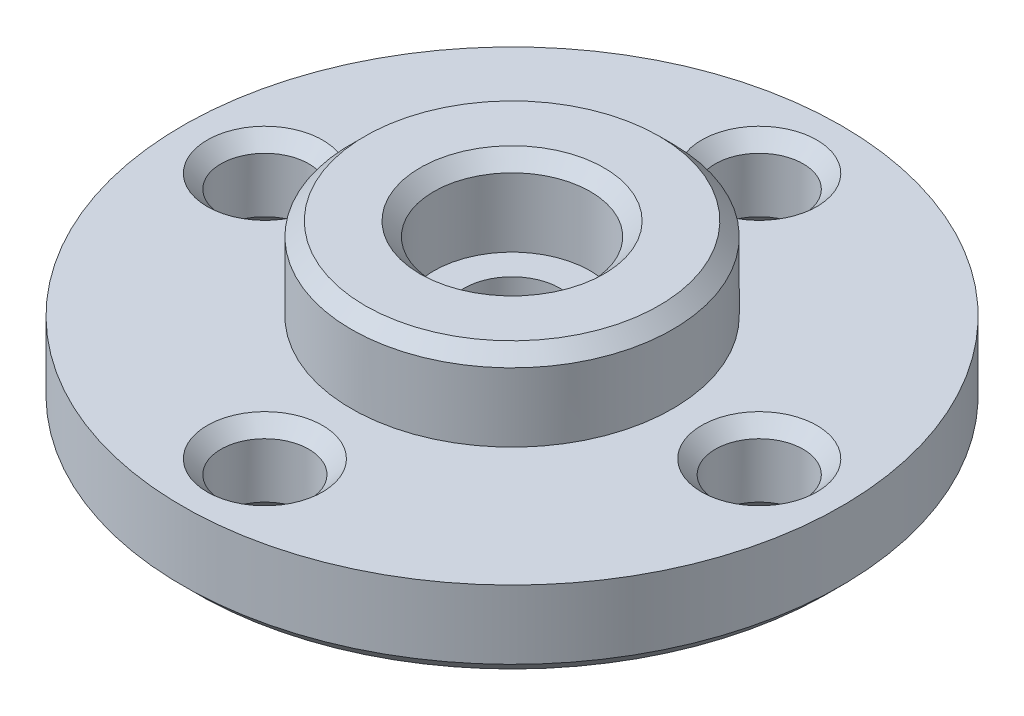
ISO-10303-21;
HEADER;
FILE_DESCRIPTION(('STEP AP214'),'2;1');
FILE_NAME('part.step','',(''),(''),'','','');
FILE_SCHEMA(('AUTOMOTIVE_DESIGN { 1 0 10303 214 1 1 1 1 }'));
ENDSEC;
DATA;
#1=APPLICATION_CONTEXT('core data for automotive mechanical design processes');
#2=APPLICATION_PROTOCOL_DEFINITION('international standard','automotive_design',2000,#1);
#3=PRODUCT_CONTEXT('',#1,'mechanical');
#4=PRODUCT('Part','Part','',(#3));
#5=PRODUCT_RELATED_PRODUCT_CATEGORY('part','',(#4));
#6=PRODUCT_DEFINITION_FORMATION('','',#4);
#7=PRODUCT_DEFINITION_CONTEXT('part definition',#1,'design');
#8=PRODUCT_DEFINITION('design','',#6,#7);
#9=PRODUCT_DEFINITION_SHAPE('','',#8);
#10=(LENGTH_UNIT() NAMED_UNIT(*) SI_UNIT(.MILLI.,.METRE.));
#11=(NAMED_UNIT(*) PLANE_ANGLE_UNIT() SI_UNIT($,.RADIAN.));
#12=(NAMED_UNIT(*) SI_UNIT($,.STERADIAN.) SOLID_ANGLE_UNIT());
#13=UNCERTAINTY_MEASURE_WITH_UNIT(LENGTH_MEASURE(1.E-05),#10,'distance_accuracy_value','');
#14=(GEOMETRIC_REPRESENTATION_CONTEXT(3) GLOBAL_UNCERTAINTY_ASSIGNED_CONTEXT((#13)) GLOBAL_UNIT_ASSIGNED_CONTEXT((#10,
#11,#12)) REPRESENTATION_CONTEXT('',''));
#15=CARTESIAN_POINT('',(0.,0.,0.));
#16=DIRECTION('',(0.,0.,1.));
#17=DIRECTION('',(1.,0.,0.));
#18=AXIS2_PLACEMENT_3D('',#15,#16,#17);
#19=CARTESIAN_POINT('',(12.,0.,0.));
#20=DIRECTION('',(0.,-1.,0.));
#21=DIRECTION('',(0.,0.,-1.));
#22=AXIS2_PLACEMENT_3D('',#19,#20,#21);
#23=PLANE('',#22);
#24=CARTESIAN_POINT('',(0.,0.,0.));
#25=DIRECTION('',(0.,-1.,0.));
#26=DIRECTION('',(0.,0.,-1.));
#27=AXIS2_PLACEMENT_3D('',#24,#25,#26);
#28=CIRCLE('',#27,2.25);
#29=CARTESIAN_POINT('',(0.,0.,-2.25));
#30=VERTEX_POINT('',#29);
#31=EDGE_CURVE('E90',#30,#30,#28,.F.);
#32=ORIENTED_EDGE('',*,*,#31,.T.);
#33=EDGE_LOOP('',(#32));
#34=FACE_BOUND('',#33,.T.);
#35=CARTESIAN_POINT('',(0.,0.,0.));
#36=DIRECTION('',(0.,-1.,0.));
#37=DIRECTION('',(0.,0.,-1.));
#38=AXIS2_PLACEMENT_3D('',#35,#36,#37);
#39=CIRCLE('',#38,11.5);
#40=CARTESIAN_POINT('',(0.,0.,-11.5));
#41=VERTEX_POINT('',#40);
#42=EDGE_CURVE('E93',#41,#41,#39,.T.);
#43=ORIENTED_EDGE('',*,*,#42,.T.);
#44=EDGE_LOOP('',(#43));
#45=FACE_BOUND('',#44,.T.);
#46=CARTESIAN_POINT('',(9.,0.,0.));
#47=DIRECTION('',(0.,-1.,0.));
#48=DIRECTION('',(0.,0.,-1.));
#49=AXIS2_PLACEMENT_3D('',#46,#47,#48);
#50=CIRCLE('',#49,2.10000000000001);
#51=CARTESIAN_POINT('',(9.,0.,-2.10000000000001));
#52=VERTEX_POINT('',#51);
#53=EDGE_CURVE('E96',#52,#52,#50,.F.);
#54=ORIENTED_EDGE('',*,*,#53,.T.);
#55=EDGE_LOOP('',(#54));
#56=FACE_BOUND('',#55,.T.);
#57=CARTESIAN_POINT('',(0.,0.,9.));
#58=DIRECTION('',(0.,-1.,0.));
#59=DIRECTION('',(0.,0.,-1.));
#60=AXIS2_PLACEMENT_3D('',#57,#58,#59);
#61=CIRCLE('',#60,2.10000000000001);
#62=CARTESIAN_POINT('',(0.,0.,6.89999999999999));
#63=VERTEX_POINT('',#62);
#64=EDGE_CURVE('E99',#63,#63,#61,.F.);
#65=ORIENTED_EDGE('',*,*,#64,.T.);
#66=EDGE_LOOP('',(#65));
#67=FACE_BOUND('',#66,.T.);
#68=CARTESIAN_POINT('',(-9.,0.,0.));
#69=DIRECTION('',(0.,-1.,0.));
#70=DIRECTION('',(0.,0.,-1.));
#71=AXIS2_PLACEMENT_3D('',#68,#69,#70);
#72=CIRCLE('',#71,2.10000000000001);
#73=CARTESIAN_POINT('',(-9.,0.,-2.10000000000001));
#74=VERTEX_POINT('',#73);
#75=EDGE_CURVE('E102',#74,#74,#72,.F.);
#76=ORIENTED_EDGE('',*,*,#75,.T.);
#77=EDGE_LOOP('',(#76));
#78=FACE_BOUND('',#77,.T.);
#79=CARTESIAN_POINT('',(0.,0.,-9.));
#80=DIRECTION('',(0.,-1.,0.));
#81=DIRECTION('',(0.,0.,-1.));
#82=AXIS2_PLACEMENT_3D('',#79,#80,#81);
#83=CIRCLE('',#82,2.10000000000001);
#84=CARTESIAN_POINT('',(0.,0.,-11.1));
#85=VERTEX_POINT('',#84);
#86=EDGE_CURVE('E105',#85,#85,#83,.F.);
#87=ORIENTED_EDGE('',*,*,#86,.T.);
#88=EDGE_LOOP('',(#87));
#89=FACE_BOUND('',#88,.T.);
#90=ADVANCED_FACE('F31',(#34,#45,#56,#67,#78,#89),#23,.T.);
#91=CARTESIAN_POINT('',(0.,-26.6259795405371,0.));
#92=DIRECTION('',(0.,-1.,0.));
#93=DIRECTION('',(0.,0.,-1.));
#94=AXIS2_PLACEMENT_3D('',#91,#92,#93);
#95=CYLINDRICAL_SURFACE('',#94,1.75);
#96=CARTESIAN_POINT('',(0.,0.499999999999997,0.));
#97=DIRECTION('',(0.,-1.,0.));
#98=DIRECTION('',(0.,0.,-1.));
#99=AXIS2_PLACEMENT_3D('',#96,#97,#98);
#100=CIRCLE('',#99,1.75);
#101=CARTESIAN_POINT('',(0.,0.499999999999997,-1.75));
#102=VERTEX_POINT('',#101);
#103=EDGE_CURVE('E108',#102,#102,#100,.T.);
#104=ORIENTED_EDGE('',*,*,#103,.T.);
#105=EDGE_LOOP('',(#104));
#106=FACE_BOUND('',#105,.T.);
#107=CARTESIAN_POINT('',(0.,3.,0.));
#108=DIRECTION('',(0.,-1.,0.));
#109=DIRECTION('',(0.,0.,-1.));
#110=AXIS2_PLACEMENT_3D('',#107,#108,#109);
#111=CIRCLE('',#110,1.75);
#112=CARTESIAN_POINT('',(0.,3.,-1.75));
#113=VERTEX_POINT('',#112);
#114=EDGE_CURVE('E111',#113,#113,#111,.T.);
#115=ORIENTED_EDGE('',*,*,#114,.F.);
#116=EDGE_LOOP('',(#115));
#117=FACE_BOUND('',#116,.T.);
#118=ADVANCED_FACE('F142',(#106,#117),#95,.F.);
#119=CARTESIAN_POINT('',(1.75,3.,0.));
#120=DIRECTION('',(0.,1.,0.));
#121=DIRECTION('',(0.,0.,1.));
#122=AXIS2_PLACEMENT_3D('',#119,#120,#121);
#123=PLANE('',#122);
#124=ORIENTED_EDGE('',*,*,#114,.T.);
#125=EDGE_LOOP('',(#124));
#126=FACE_BOUND('',#125,.T.);
#127=CARTESIAN_POINT('',(0.,3.,0.));
#128=DIRECTION('',(0.,-1.,0.));
#129=DIRECTION('',(0.,0.,-1.));
#130=AXIS2_PLACEMENT_3D('',#127,#128,#129);
#131=CIRCLE('',#130,2.85);
#132=CARTESIAN_POINT('',(0.,3.,-2.85));
#133=VERTEX_POINT('',#132);
#134=EDGE_CURVE('E114',#133,#133,#131,.T.);
#135=ORIENTED_EDGE('',*,*,#134,.F.);
#136=EDGE_LOOP('',(#135));
#137=FACE_BOUND('',#136,.T.);
#138=ADVANCED_FACE('F148',(#126,#137),#123,.T.);
#139=CARTESIAN_POINT('',(0.,-26.6259795405371,0.));
#140=DIRECTION('',(0.,-1.,0.));
#141=DIRECTION('',(0.,0.,-1.));
#142=AXIS2_PLACEMENT_3D('',#139,#140,#141);
#143=CYLINDRICAL_SURFACE('',#142,2.85);
#144=CARTESIAN_POINT('',(0.,5.49999999999999,0.));
#145=DIRECTION('',(0.,1.,0.));
#146=DIRECTION('',(0.,0.,1.));
#147=AXIS2_PLACEMENT_3D('',#144,#145,#146);
#148=CIRCLE('',#147,2.85);
#149=CARTESIAN_POINT('',(0.,5.49999999999999,2.85));
#150=VERTEX_POINT('',#149);
#151=EDGE_CURVE('E38',#150,#150,#148,.T.);
#152=ORIENTED_EDGE('',*,*,#151,.T.);
#153=EDGE_LOOP('',(#152));
#154=FACE_BOUND('',#153,.T.);
#155=ORIENTED_EDGE('',*,*,#134,.T.);
#156=EDGE_LOOP('',(#155));
#157=FACE_BOUND('',#156,.T.);
#158=ADVANCED_FACE('F206',(#154,#157),#143,.F.);
#159=CARTESIAN_POINT('',(2.85,6.,0.));
#160=DIRECTION('',(0.,1.,0.));
#161=DIRECTION('',(0.,0.,1.));
#162=AXIS2_PLACEMENT_3D('',#159,#160,#161);
#163=PLANE('',#162);
#164=CARTESIAN_POINT('',(0.,6.,0.));
#165=DIRECTION('',(0.,1.,0.));
#166=DIRECTION('',(0.,0.,1.));
#167=AXIS2_PLACEMENT_3D('',#164,#165,#166);
#168=CIRCLE('',#167,3.35000000000001);
#169=CARTESIAN_POINT('',(0.,6.,3.35000000000001));
#170=VERTEX_POINT('',#169);
#171=EDGE_CURVE('E42',#170,#170,#168,.F.);
#172=ORIENTED_EDGE('',*,*,#171,.T.);
#173=EDGE_LOOP('',(#172));
#174=FACE_BOUND('',#173,.T.);
#175=CARTESIAN_POINT('',(0.,6.,0.));
#176=DIRECTION('',(0.,1.,0.));
#177=DIRECTION('',(0.,0.,1.));
#178=AXIS2_PLACEMENT_3D('',#175,#176,#177);
#179=CIRCLE('',#178,5.34999999999999);
#180=CARTESIAN_POINT('',(0.,6.,5.34999999999999));
#181=VERTEX_POINT('',#180);
#182=EDGE_CURVE('E46',#181,#181,#179,.T.);
#183=ORIENTED_EDGE('',*,*,#182,.T.);
#184=EDGE_LOOP('',(#183));
#185=FACE_BOUND('',#184,.T.);
#186=ADVANCED_FACE('F138',(#174,#185),#163,.T.);
#187=CARTESIAN_POINT('',(0.,-26.6259795405371,0.));
#188=DIRECTION('',(0.,-1.,0.));
#189=DIRECTION('',(0.,0.,-1.));
#190=AXIS2_PLACEMENT_3D('',#187,#188,#189);
#191=CYLINDRICAL_SURFACE('',#190,5.85);
#192=CARTESIAN_POINT('',(0.,5.5,0.));
#193=DIRECTION('',(0.,1.,0.));
#194=DIRECTION('',(0.,0.,1.));
#195=AXIS2_PLACEMENT_3D('',#192,#193,#194);
#196=CIRCLE('',#195,5.85);
#197=CARTESIAN_POINT('',(0.,5.5,5.85));
#198=VERTEX_POINT('',#197);
#199=EDGE_CURVE('E10',#198,#198,#196,.F.);
#200=ORIENTED_EDGE('',*,*,#199,.T.);
#201=EDGE_LOOP('',(#200));
#202=FACE_BOUND('',#201,.T.);
#203=CARTESIAN_POINT('',(0.,3.,0.));
#204=DIRECTION('',(0.,-1.,0.));
#205=DIRECTION('',(0.,0.,-1.));
#206=AXIS2_PLACEMENT_3D('',#203,#204,#205);
#207=CIRCLE('',#206,5.85);
#208=CARTESIAN_POINT('',(0.,3.,-5.85));
#209=VERTEX_POINT('',#208);
#210=EDGE_CURVE('E117',#209,#209,#207,.T.);
#211=ORIENTED_EDGE('',*,*,#210,.F.);
#212=EDGE_LOOP('',(#211));
#213=FACE_BOUND('',#212,.T.);
#214=ADVANCED_FACE('F128',(#202,#213),#191,.T.);
#215=CARTESIAN_POINT('',(5.85,3.,0.));
#216=DIRECTION('',(0.,1.,0.));
#217=DIRECTION('',(0.,0.,1.));
#218=AXIS2_PLACEMENT_3D('',#215,#216,#217);
#219=PLANE('',#218);
#220=CARTESIAN_POINT('',(0.,3.,9.));
#221=DIRECTION('',(0.,1.,0.));
#222=DIRECTION('',(0.,0.,1.));
#223=AXIS2_PLACEMENT_3D('',#220,#221,#222);
#224=CIRCLE('',#223,2.1);
#225=CARTESIAN_POINT('',(0.,3.,11.1));
#226=VERTEX_POINT('',#225);
#227=EDGE_CURVE('E51',#226,#226,#224,.F.);
#228=ORIENTED_EDGE('',*,*,#227,.T.);
#229=EDGE_LOOP('',(#228));
#230=FACE_BOUND('',#229,.T.);
#231=CARTESIAN_POINT('',(-9.,3.,0.));
#232=DIRECTION('',(0.,1.,0.));
#233=DIRECTION('',(0.,0.,1.));
#234=AXIS2_PLACEMENT_3D('',#231,#232,#233);
#235=CIRCLE('',#234,2.1);
#236=CARTESIAN_POINT('',(-9.,3.,2.1));
#237=VERTEX_POINT('',#236);
#238=EDGE_CURVE('E54',#237,#237,#235,.F.);
#239=ORIENTED_EDGE('',*,*,#238,.T.);
#240=EDGE_LOOP('',(#239));
#241=FACE_BOUND('',#240,.T.);
#242=CARTESIAN_POINT('',(0.,3.,-9.));
#243=DIRECTION('',(0.,1.,0.));
#244=DIRECTION('',(0.,0.,1.));
#245=AXIS2_PLACEMENT_3D('',#242,#243,#244);
#246=CIRCLE('',#245,2.1);
#247=CARTESIAN_POINT('',(0.,3.,-6.9));
#248=VERTEX_POINT('',#247);
#249=EDGE_CURVE('E57',#248,#248,#246,.F.);
#250=ORIENTED_EDGE('',*,*,#249,.T.);
#251=EDGE_LOOP('',(#250));
#252=FACE_BOUND('',#251,.T.);
#253=CARTESIAN_POINT('',(9.,3.,0.));
#254=DIRECTION('',(0.,1.,0.));
#255=DIRECTION('',(0.,0.,1.));
#256=AXIS2_PLACEMENT_3D('',#253,#254,#255);
#257=CIRCLE('',#256,2.1);
#258=CARTESIAN_POINT('',(9.,3.,2.1));
#259=VERTEX_POINT('',#258);
#260=EDGE_CURVE('E60',#259,#259,#257,.F.);
#261=ORIENTED_EDGE('',*,*,#260,.T.);
#262=EDGE_LOOP('',(#261));
#263=FACE_BOUND('',#262,.T.);
#264=ORIENTED_EDGE('',*,*,#210,.T.);
#265=EDGE_LOOP('',(#264));
#266=FACE_BOUND('',#265,.T.);
#267=CARTESIAN_POINT('',(0.,3.,0.));
#268=DIRECTION('',(0.,-1.,0.));
#269=DIRECTION('',(0.,0.,-1.));
#270=AXIS2_PLACEMENT_3D('',#267,#268,#269);
#271=CIRCLE('',#270,12.);
#272=CARTESIAN_POINT('',(0.,3.,-12.));
#273=VERTEX_POINT('',#272);
#274=EDGE_CURVE('E120',#273,#273,#271,.T.);
#275=ORIENTED_EDGE('',*,*,#274,.F.);
#276=EDGE_LOOP('',(#275));
#277=FACE_BOUND('',#276,.T.);
#278=ADVANCED_FACE('F126',(#230,#241,#252,#263,#266,#277),#219,.T.);
#279=CARTESIAN_POINT('',(0.,-26.6259795405371,0.));
#280=DIRECTION('',(0.,-1.,0.));
#281=DIRECTION('',(0.,0.,-1.));
#282=AXIS2_PLACEMENT_3D('',#279,#280,#281);
#283=CYLINDRICAL_SURFACE('',#282,12.);
#284=CARTESIAN_POINT('',(0.,0.499999999999997,0.));
#285=DIRECTION('',(0.,-1.,0.));
#286=DIRECTION('',(0.,0.,-1.));
#287=AXIS2_PLACEMENT_3D('',#284,#285,#286);
#288=CIRCLE('',#287,12.);
#289=CARTESIAN_POINT('',(0.,0.499999999999997,-12.));
#290=VERTEX_POINT('',#289);
#291=EDGE_CURVE('E87',#290,#290,#288,.F.);
#292=ORIENTED_EDGE('',*,*,#291,.T.);
#293=EDGE_LOOP('',(#292));
#294=FACE_BOUND('',#293,.T.);
#295=ORIENTED_EDGE('',*,*,#274,.T.);
#296=EDGE_LOOP('',(#295));
#297=FACE_BOUND('',#296,.T.);
#298=ADVANCED_FACE('F124',(#294,#297),#283,.T.);
#299=CARTESIAN_POINT('',(9.,0.,0.));
#300=DIRECTION('',(0.,1.,0.));
#301=DIRECTION('',(0.,0.,1.));
#302=AXIS2_PLACEMENT_3D('',#299,#300,#301);
#303=CYLINDRICAL_SURFACE('',#302,1.6);
#304=CARTESIAN_POINT('',(9.,0.500000000000007,0.));
#305=DIRECTION('',(0.,-1.,0.));
#306=DIRECTION('',(0.,0.,-1.));
#307=AXIS2_PLACEMENT_3D('',#304,#305,#306);
#308=CIRCLE('',#307,1.6);
#309=CARTESIAN_POINT('',(9.,0.500000000000007,-1.6));
#310=VERTEX_POINT('',#309);
#311=EDGE_CURVE('E81',#310,#310,#308,.T.);
#312=ORIENTED_EDGE('',*,*,#311,.T.);
#313=EDGE_LOOP('',(#312));
#314=FACE_BOUND('',#313,.T.);
#315=CARTESIAN_POINT('',(9.,2.5,0.));
#316=DIRECTION('',(0.,1.,0.));
#317=DIRECTION('',(0.,0.,1.));
#318=AXIS2_PLACEMENT_3D('',#315,#316,#317);
#319=CIRCLE('',#318,1.6);
#320=CARTESIAN_POINT('',(9.,2.5,1.6));
#321=VERTEX_POINT('',#320);
#322=EDGE_CURVE('E84',#321,#321,#319,.T.);
#323=ORIENTED_EDGE('',*,*,#322,.T.);
#324=EDGE_LOOP('',(#323));
#325=FACE_BOUND('',#324,.T.);
#326=ADVANCED_FACE('F135',(#314,#325),#303,.F.);
#327=CARTESIAN_POINT('',(0.,0.,9.));
#328=DIRECTION('',(0.,1.,0.));
#329=DIRECTION('',(0.,0.,1.));
#330=AXIS2_PLACEMENT_3D('',#327,#328,#329);
#331=CYLINDRICAL_SURFACE('',#330,1.6);
#332=CARTESIAN_POINT('',(0.,0.500000000000007,9.));
#333=DIRECTION('',(0.,-1.,0.));
#334=DIRECTION('',(0.,0.,-1.));
#335=AXIS2_PLACEMENT_3D('',#332,#333,#334);
#336=CIRCLE('',#335,1.6);
#337=CARTESIAN_POINT('',(0.,0.500000000000007,7.4));
#338=VERTEX_POINT('',#337);
#339=EDGE_CURVE('E75',#338,#338,#336,.T.);
#340=ORIENTED_EDGE('',*,*,#339,.T.);
#341=EDGE_LOOP('',(#340));
#342=FACE_BOUND('',#341,.T.);
#343=CARTESIAN_POINT('',(0.,2.5,9.));
#344=DIRECTION('',(0.,1.,0.));
#345=DIRECTION('',(0.,0.,1.));
#346=AXIS2_PLACEMENT_3D('',#343,#344,#345);
#347=CIRCLE('',#346,1.6);
#348=CARTESIAN_POINT('',(0.,2.5,10.6));
#349=VERTEX_POINT('',#348);
#350=EDGE_CURVE('E78',#349,#349,#347,.T.);
#351=ORIENTED_EDGE('',*,*,#350,.T.);
#352=EDGE_LOOP('',(#351));
#353=FACE_BOUND('',#352,.T.);
#354=ADVANCED_FACE('F260',(#342,#353),#331,.F.);
#355=CARTESIAN_POINT('',(-9.,0.,0.));
#356=DIRECTION('',(0.,1.,0.));
#357=DIRECTION('',(0.,0.,1.));
#358=AXIS2_PLACEMENT_3D('',#355,#356,#357);
#359=CYLINDRICAL_SURFACE('',#358,1.6);
#360=CARTESIAN_POINT('',(-9.,0.500000000000007,0.));
#361=DIRECTION('',(0.,-1.,0.));
#362=DIRECTION('',(0.,0.,-1.));
#363=AXIS2_PLACEMENT_3D('',#360,#361,#362);
#364=CIRCLE('',#363,1.6);
#365=CARTESIAN_POINT('',(-9.,0.500000000000007,-1.6));
#366=VERTEX_POINT('',#365);
#367=EDGE_CURVE('E69',#366,#366,#364,.T.);
#368=ORIENTED_EDGE('',*,*,#367,.T.);
#369=EDGE_LOOP('',(#368));
#370=FACE_BOUND('',#369,.T.);
#371=CARTESIAN_POINT('',(-9.,2.5,0.));
#372=DIRECTION('',(0.,1.,0.));
#373=DIRECTION('',(0.,0.,1.));
#374=AXIS2_PLACEMENT_3D('',#371,#372,#373);
#375=CIRCLE('',#374,1.6);
#376=CARTESIAN_POINT('',(-9.,2.5,1.6));
#377=VERTEX_POINT('',#376);
#378=EDGE_CURVE('E72',#377,#377,#375,.T.);
#379=ORIENTED_EDGE('',*,*,#378,.T.);
#380=EDGE_LOOP('',(#379));
#381=FACE_BOUND('',#380,.T.);
#382=ADVANCED_FACE('F270',(#370,#381),#359,.F.);
#383=CARTESIAN_POINT('',(0.,0.,-9.));
#384=DIRECTION('',(0.,1.,0.));
#385=DIRECTION('',(0.,0.,1.));
#386=AXIS2_PLACEMENT_3D('',#383,#384,#385);
#387=CYLINDRICAL_SURFACE('',#386,1.6);
#388=CARTESIAN_POINT('',(0.,0.500000000000007,-9.));
#389=DIRECTION('',(0.,-1.,0.));
#390=DIRECTION('',(0.,0.,-1.));
#391=AXIS2_PLACEMENT_3D('',#388,#389,#390);
#392=CIRCLE('',#391,1.6);
#393=CARTESIAN_POINT('',(0.,0.500000000000007,-10.6));
#394=VERTEX_POINT('',#393);
#395=EDGE_CURVE('E63',#394,#394,#392,.T.);
#396=ORIENTED_EDGE('',*,*,#395,.T.);
#397=EDGE_LOOP('',(#396));
#398=FACE_BOUND('',#397,.T.);
#399=CARTESIAN_POINT('',(0.,2.5,-9.));
#400=DIRECTION('',(0.,1.,0.));
#401=DIRECTION('',(0.,0.,1.));
#402=AXIS2_PLACEMENT_3D('',#399,#400,#401);
#403=CIRCLE('',#402,1.6);
#404=CARTESIAN_POINT('',(0.,2.5,-7.4));
#405=VERTEX_POINT('',#404);
#406=EDGE_CURVE('E66',#405,#405,#403,.T.);
#407=ORIENTED_EDGE('',*,*,#406,.T.);
#408=EDGE_LOOP('',(#407));
#409=FACE_BOUND('',#408,.T.);
#410=ADVANCED_FACE('F158',(#398,#409),#387,.F.);
#411=CARTESIAN_POINT('',(0.,0.499999999999997,0.));
#412=DIRECTION('',(0.,-1.,0.));
#413=DIRECTION('',(0.,0.,-1.));
#414=AXIS2_PLACEMENT_3D('',#411,#412,#413);
#415=CONICAL_SURFACE('',#414,1.75,0.785398163397453);
#416=ORIENTED_EDGE('',*,*,#31,.F.);
#417=EDGE_LOOP('',(#416));
#418=FACE_BOUND('',#417,.T.);
#419=ORIENTED_EDGE('',*,*,#103,.F.);
#420=EDGE_LOOP('',(#419));
#421=FACE_BOUND('',#420,.T.);
#422=ADVANCED_FACE('F154',(#418,#421),#415,.F.);
#423=CARTESIAN_POINT('',(0.,0.,0.));
#424=DIRECTION('',(0.,1.,0.));
#425=DIRECTION('',(0.,0.,1.));
#426=AXIS2_PLACEMENT_3D('',#423,#424,#425);
#427=CONICAL_SURFACE('',#426,11.5,0.785398163397447);
#428=ORIENTED_EDGE('',*,*,#291,.F.);
#429=EDGE_LOOP('',(#428));
#430=FACE_BOUND('',#429,.T.);
#431=ORIENTED_EDGE('',*,*,#42,.F.);
#432=EDGE_LOOP('',(#431));
#433=FACE_BOUND('',#432,.T.);
#434=ADVANCED_FACE('F157',(#430,#433),#427,.T.);
#435=CARTESIAN_POINT('',(9.,0.,0.));
#436=DIRECTION('',(0.,-1.,0.));
#437=DIRECTION('',(0.,0.,-1.));
#438=AXIS2_PLACEMENT_3D('',#435,#436,#437);
#439=CONICAL_SURFACE('',#438,2.10000000000001,0.785398163397447);
#440=ORIENTED_EDGE('',*,*,#311,.F.);
#441=EDGE_LOOP('',(#440));
#442=FACE_BOUND('',#441,.T.);
#443=ORIENTED_EDGE('',*,*,#53,.F.);
#444=EDGE_LOOP('',(#443));
#445=FACE_BOUND('',#444,.T.);
#446=ADVANCED_FACE('F162',(#442,#445),#439,.F.);
#447=CARTESIAN_POINT('',(0.,0.,9.));
#448=DIRECTION('',(0.,-1.,0.));
#449=DIRECTION('',(0.,0.,-1.));
#450=AXIS2_PLACEMENT_3D('',#447,#448,#449);
#451=CONICAL_SURFACE('',#450,2.10000000000001,0.785398163397447);
#452=ORIENTED_EDGE('',*,*,#339,.F.);
#453=EDGE_LOOP('',(#452));
#454=FACE_BOUND('',#453,.T.);
#455=ORIENTED_EDGE('',*,*,#64,.F.);
#456=EDGE_LOOP('',(#455));
#457=FACE_BOUND('',#456,.T.);
#458=ADVANCED_FACE('F166',(#454,#457),#451,.F.);
#459=CARTESIAN_POINT('',(-9.,0.,0.));
#460=DIRECTION('',(0.,-1.,0.));
#461=DIRECTION('',(0.,0.,-1.));
#462=AXIS2_PLACEMENT_3D('',#459,#460,#461);
#463=CONICAL_SURFACE('',#462,2.10000000000001,0.785398163397447);
#464=ORIENTED_EDGE('',*,*,#367,.F.);
#465=EDGE_LOOP('',(#464));
#466=FACE_BOUND('',#465,.T.);
#467=ORIENTED_EDGE('',*,*,#75,.F.);
#468=EDGE_LOOP('',(#467));
#469=FACE_BOUND('',#468,.T.);
#470=ADVANCED_FACE('F170',(#466,#469),#463,.F.);
#471=CARTESIAN_POINT('',(0.,0.,-9.));
#472=DIRECTION('',(0.,-1.,0.));
#473=DIRECTION('',(0.,0.,-1.));
#474=AXIS2_PLACEMENT_3D('',#471,#472,#473);
#475=CONICAL_SURFACE('',#474,2.10000000000001,0.785398163397447);
#476=ORIENTED_EDGE('',*,*,#395,.F.);
#477=EDGE_LOOP('',(#476));
#478=FACE_BOUND('',#477,.T.);
#479=ORIENTED_EDGE('',*,*,#86,.F.);
#480=EDGE_LOOP('',(#479));
#481=FACE_BOUND('',#480,.T.);
#482=ADVANCED_FACE('F174',(#478,#481),#475,.F.);
#483=CARTESIAN_POINT('',(0.,2.5,9.));
#484=DIRECTION('',(0.,1.,0.));
#485=DIRECTION('',(0.,0.,1.));
#486=AXIS2_PLACEMENT_3D('',#483,#484,#485);
#487=CONICAL_SURFACE('',#486,1.6,0.78539816339745);
#488=ORIENTED_EDGE('',*,*,#227,.F.);
#489=EDGE_LOOP('',(#488));
#490=FACE_BOUND('',#489,.T.);
#491=ORIENTED_EDGE('',*,*,#350,.F.);
#492=EDGE_LOOP('',(#491));
#493=FACE_BOUND('',#492,.T.);
#494=ADVANCED_FACE('F178',(#490,#493),#487,.F.);
#495=CARTESIAN_POINT('',(-9.,2.5,0.));
#496=DIRECTION('',(0.,1.,0.));
#497=DIRECTION('',(0.,0.,1.));
#498=AXIS2_PLACEMENT_3D('',#495,#496,#497);
#499=CONICAL_SURFACE('',#498,1.6,0.78539816339745);
#500=ORIENTED_EDGE('',*,*,#238,.F.);
#501=EDGE_LOOP('',(#500));
#502=FACE_BOUND('',#501,.T.);
#503=ORIENTED_EDGE('',*,*,#378,.F.);
#504=EDGE_LOOP('',(#503));
#505=FACE_BOUND('',#504,.T.);
#506=ADVANCED_FACE('F182',(#502,#505),#499,.F.);
#507=CARTESIAN_POINT('',(0.,2.5,-9.));
#508=DIRECTION('',(0.,1.,0.));
#509=DIRECTION('',(0.,0.,1.));
#510=AXIS2_PLACEMENT_3D('',#507,#508,#509);
#511=CONICAL_SURFACE('',#510,1.6,0.78539816339745);
#512=ORIENTED_EDGE('',*,*,#249,.F.);
#513=EDGE_LOOP('',(#512));
#514=FACE_BOUND('',#513,.T.);
#515=ORIENTED_EDGE('',*,*,#406,.F.);
#516=EDGE_LOOP('',(#515));
#517=FACE_BOUND('',#516,.T.);
#518=ADVANCED_FACE('F186',(#514,#517),#511,.F.);
#519=CARTESIAN_POINT('',(9.,2.5,0.));
#520=DIRECTION('',(0.,1.,0.));
#521=DIRECTION('',(0.,0.,1.));
#522=AXIS2_PLACEMENT_3D('',#519,#520,#521);
#523=CONICAL_SURFACE('',#522,1.6,0.78539816339745);
#524=ORIENTED_EDGE('',*,*,#260,.F.);
#525=EDGE_LOOP('',(#524));
#526=FACE_BOUND('',#525,.T.);
#527=ORIENTED_EDGE('',*,*,#322,.F.);
#528=EDGE_LOOP('',(#527));
#529=FACE_BOUND('',#528,.T.);
#530=ADVANCED_FACE('F190',(#526,#529),#523,.F.);
#531=CARTESIAN_POINT('',(0.,6.,0.));
#532=DIRECTION('',(0.,1.,0.));
#533=DIRECTION('',(0.,0.,1.));
#534=AXIS2_PLACEMENT_3D('',#531,#532,#533);
#535=CONICAL_SURFACE('',#534,3.35000000000001,0.785398163397446);
#536=ORIENTED_EDGE('',*,*,#151,.F.);
#537=EDGE_LOOP('',(#536));
#538=FACE_BOUND('',#537,.T.);
#539=ORIENTED_EDGE('',*,*,#171,.F.);
#540=EDGE_LOOP('',(#539));
#541=FACE_BOUND('',#540,.T.);
#542=ADVANCED_FACE('F193',(#538,#541),#535,.F.);
#543=CARTESIAN_POINT('',(0.,5.5,0.));
#544=DIRECTION('',(0.,-1.,0.));
#545=DIRECTION('',(0.,0.,-1.));
#546=AXIS2_PLACEMENT_3D('',#543,#544,#545);
#547=CONICAL_SURFACE('',#546,5.85,0.785398163397453);
#548=ORIENTED_EDGE('',*,*,#182,.F.);
#549=EDGE_LOOP('',(#548));
#550=FACE_BOUND('',#549,.T.);
#551=ORIENTED_EDGE('',*,*,#199,.F.);
#552=EDGE_LOOP('',(#551));
#553=FACE_BOUND('',#552,.T.);
#554=ADVANCED_FACE('F33',(#550,#553),#547,.T.);
#555=CLOSED_SHELL('',(#90,#118,#138,#158,#186,#214,#278,#298,#326,#354,#382,#410,#422,#434,#446,
#458,#470,#482,#494,#506,#518,#530,#542,#554));
#556=MANIFOLD_SOLID_BREP('B2',#555);
#557=ADVANCED_BREP_SHAPE_REPRESENTATION('',(#18,#556),#14);
#558=SHAPE_DEFINITION_REPRESENTATION(#9,#557);
ENDSEC;
END-ISO-10303-21;
